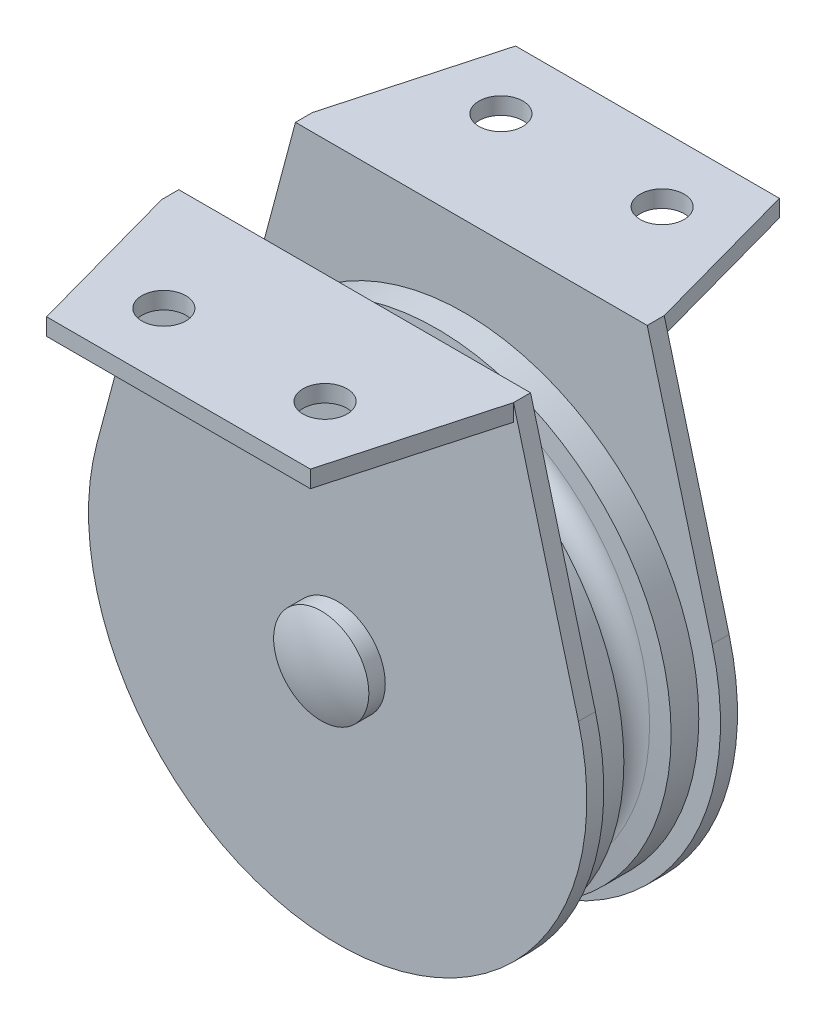
ISO-10303-21;
HEADER;
FILE_DESCRIPTION(('STEP AP214'),'2;1');
FILE_NAME('part.step','',(''),(''),'','','');
FILE_SCHEMA(('AUTOMOTIVE_DESIGN { 1 0 10303 214 1 1 1 1 }'));
ENDSEC;
DATA;
#1=APPLICATION_CONTEXT('core data for automotive mechanical design processes');
#2=APPLICATION_PROTOCOL_DEFINITION('international standard','automotive_design',2000,#1);
#3=PRODUCT_CONTEXT('',#1,'mechanical');
#4=PRODUCT('Part','Part','',(#3));
#5=PRODUCT_RELATED_PRODUCT_CATEGORY('part','',(#4));
#6=PRODUCT_DEFINITION_FORMATION('','',#4);
#7=PRODUCT_DEFINITION_CONTEXT('part definition',#1,'design');
#8=PRODUCT_DEFINITION('design','',#6,#7);
#9=PRODUCT_DEFINITION_SHAPE('','',#8);
#10=(LENGTH_UNIT() NAMED_UNIT(*) SI_UNIT(.MILLI.,.METRE.));
#11=(NAMED_UNIT(*) PLANE_ANGLE_UNIT() SI_UNIT($,.RADIAN.));
#12=(NAMED_UNIT(*) SI_UNIT($,.STERADIAN.) SOLID_ANGLE_UNIT());
#13=UNCERTAINTY_MEASURE_WITH_UNIT(LENGTH_MEASURE(1.E-05),#10,'distance_accuracy_value','');
#14=(GEOMETRIC_REPRESENTATION_CONTEXT(3) GLOBAL_UNCERTAINTY_ASSIGNED_CONTEXT((#13)) GLOBAL_UNIT_ASSIGNED_CONTEXT((#10,
#11,#12)) REPRESENTATION_CONTEXT('',''));
#15=CARTESIAN_POINT('',(0.,0.,0.));
#16=DIRECTION('',(0.,0.,1.));
#17=DIRECTION('',(1.,0.,0.));
#18=AXIS2_PLACEMENT_3D('',#15,#16,#17);
#19=CARTESIAN_POINT('',(0.,0.,-9.93775));
#20=DIRECTION('',(0.,0.,1.));
#21=DIRECTION('',(1.,0.,0.));
#22=AXIS2_PLACEMENT_3D('',#19,#20,#21);
#23=CYLINDRICAL_SURFACE('',#22,6.35);
#24=CARTESIAN_POINT('',(0.,0.,-9.93775));
#25=DIRECTION('',(0.,0.,-1.));
#26=DIRECTION('',(-1.,0.,0.));
#27=AXIS2_PLACEMENT_3D('',#24,#25,#26);
#28=CIRCLE('',#27,6.35);
#29=CARTESIAN_POINT('',(-6.35,0.,-9.93775));
#30=VERTEX_POINT('',#29);
#31=EDGE_CURVE('E11',#30,#30,#28,.T.);
#32=ORIENTED_EDGE('',*,*,#31,.F.);
#33=EDGE_LOOP('',(#32));
#34=FACE_BOUND('',#33,.T.);
#35=CARTESIAN_POINT('',(0.,0.,-8.15975));
#36=DIRECTION('',(0.,0.,-1.));
#37=DIRECTION('',(-1.,0.,0.));
#38=AXIS2_PLACEMENT_3D('',#35,#36,#37);
#39=CIRCLE('',#38,6.35);
#40=CARTESIAN_POINT('',(-6.35,0.,-8.15975));
#41=VERTEX_POINT('',#40);
#42=EDGE_CURVE('E50',#41,#41,#39,.T.);
#43=ORIENTED_EDGE('',*,*,#42,.T.);
#44=EDGE_LOOP('',(#43));
#45=FACE_BOUND('',#44,.T.);
#46=ADVANCED_FACE('F43',(#34,#45),#23,.T.);
#47=CARTESIAN_POINT('',(0.,0.,-6.83080897435897));
#48=DIRECTION('',(0.,0.,1.));
#49=DIRECTION('',(1.,0.,0.));
#50=AXIS2_PLACEMENT_3D('',#47,#48,#49);
#51=SPHERICAL_SURFACE('',#50,7.06934102564103);
#52=ORIENTED_EDGE('',*,*,#31,.T.);
#53=EDGE_LOOP('',(#52));
#54=FACE_BOUND('',#53,.T.);
#55=ADVANCED_FACE('F45',(#54),#51,.T.);
#56=CARTESIAN_POINT('',(0.,0.,-8.15975));
#57=DIRECTION('',(0.,0.,-1.));
#58=DIRECTION('',(-1.,0.,0.));
#59=AXIS2_PLACEMENT_3D('',#56,#57,#58);
#60=PLANE('',#59);
#61=ORIENTED_EDGE('',*,*,#42,.F.);
#62=EDGE_LOOP('',(#61));
#63=FACE_BOUND('',#62,.T.);
#64=ADVANCED_FACE('F57',(#63),#60,.F.);
#65=CLOSED_SHELL('',(#46,#55,#64));
#66=MANIFOLD_SOLID_BREP('B2',#65);
#67=CARTESIAN_POINT('',(-19.05,33.3375,-8.15975));
#68=DIRECTION('',(0.96632078840306,-0.257340501864918,0.));
#69=DIRECTION('',(0.257340501864918,0.96632078840306,0.));
#70=AXIS2_PLACEMENT_3D('',#67,#68,#69);
#71=PLANE('',#70);
#72=DIRECTION('',(-0.257340501864918,-0.96632078840306,0.));
#73=VECTOR('',#72,1.);
#74=CARTESIAN_POINT('',(-19.05,33.3375,-6.31825));
#75=LINE('',#74,#73);
#76=CARTESIAN_POINT('',(-19.05,33.3375,-6.31825));
#77=VERTEX_POINT('',#76);
#78=CARTESIAN_POINT('',(-26.0785822770276,6.94497679407947,-6.31825));
#79=VERTEX_POINT('',#78);
#80=EDGE_CURVE('E171',#77,#79,#75,.T.);
#81=ORIENTED_EDGE('',*,*,#80,.F.);
#82=DIRECTION('',(0.,0.,1.));
#83=VECTOR('',#82,1.);
#84=CARTESIAN_POINT('',(-19.05,33.3375,-8.15975));
#85=LINE('',#84,#83);
#86=CARTESIAN_POINT('',(-19.05,33.3375,-8.15975));
#87=VERTEX_POINT('',#86);
#88=EDGE_CURVE('E209',#87,#77,#85,.T.);
#89=ORIENTED_EDGE('',*,*,#88,.F.);
#90=DIRECTION('',(-0.257340501864918,-0.96632078840306,0.));
#91=VECTOR('',#90,1.);
#92=CARTESIAN_POINT('',(-19.05,33.3375,-8.15975));
#93=LINE('',#92,#91);
#94=CARTESIAN_POINT('',(-26.0785822770276,6.94497679407947,-8.15975));
#95=VERTEX_POINT('',#94);
#96=EDGE_CURVE('E202',#87,#95,#93,.T.);
#97=ORIENTED_EDGE('',*,*,#96,.T.);
#98=DIRECTION('',(0.,0.,1.));
#99=VECTOR('',#98,1.);
#100=CARTESIAN_POINT('',(-26.0785822770276,6.94497679407947,-8.15975));
#101=LINE('',#100,#99);
#102=EDGE_CURVE('E41',#95,#79,#101,.T.);
#103=ORIENTED_EDGE('',*,*,#102,.T.);
#104=EDGE_LOOP('',(#81,#89,#97,#103));
#105=FACE_BOUND('',#104,.T.);
#106=ADVANCED_FACE('F92',(#105),#71,.F.);
#107=CARTESIAN_POINT('',(0.,0.,-8.15975));
#108=DIRECTION('',(0.,0.,1.));
#109=DIRECTION('',(-1.,0.,0.));
#110=AXIS2_PLACEMENT_3D('',#107,#108,#109);
#111=CYLINDRICAL_SURFACE('',#110,26.9875);
#112=CARTESIAN_POINT('',(0.,0.,-6.31825));
#113=DIRECTION('',(0.,0.,1.));
#114=DIRECTION('',(1.,0.,0.));
#115=AXIS2_PLACEMENT_3D('',#112,#113,#114);
#116=CIRCLE('',#115,26.9875);
#117=CARTESIAN_POINT('',(26.0785822770276,6.94497679407947,-6.31825));
#118=VERTEX_POINT('',#117);
#119=EDGE_CURVE('E211',#79,#118,#116,.T.);
#120=ORIENTED_EDGE('',*,*,#119,.F.);
#121=ORIENTED_EDGE('',*,*,#102,.F.);
#122=CARTESIAN_POINT('',(0.,0.,-8.15975));
#123=DIRECTION('',(0.,0.,1.));
#124=DIRECTION('',(1.,0.,0.));
#125=AXIS2_PLACEMENT_3D('',#122,#123,#124);
#126=CIRCLE('',#125,26.9875);
#127=CARTESIAN_POINT('',(26.0785822770276,6.94497679407947,-8.15975));
#128=VERTEX_POINT('',#127);
#129=EDGE_CURVE('E136',#95,#128,#126,.T.);
#130=ORIENTED_EDGE('',*,*,#129,.T.);
#131=DIRECTION('',(0.,0.,1.));
#132=VECTOR('',#131,1.);
#133=CARTESIAN_POINT('',(26.0785822770276,6.94497679407947,-8.15975));
#134=LINE('',#133,#132);
#135=EDGE_CURVE('E100',#128,#118,#134,.T.);
#136=ORIENTED_EDGE('',*,*,#135,.T.);
#137=EDGE_LOOP('',(#120,#121,#130,#136));
#138=FACE_BOUND('',#137,.T.);
#139=ADVANCED_FACE('F222',(#138),#111,.T.);
#140=CARTESIAN_POINT('',(26.0785822770276,6.94497679407947,-8.15975));
#141=DIRECTION('',(-0.96632078840306,-0.257340501864918,0.));
#142=DIRECTION('',(0.257340501864918,-0.96632078840306,0.));
#143=AXIS2_PLACEMENT_3D('',#140,#141,#142);
#144=PLANE('',#143);
#145=DIRECTION('',(-0.257340501864918,0.96632078840306,0.));
#146=VECTOR('',#145,1.);
#147=CARTESIAN_POINT('',(26.0785822770276,6.94497679407947,-6.31825));
#148=LINE('',#147,#146);
#149=CARTESIAN_POINT('',(19.05,33.3375,-6.31825));
#150=VERTEX_POINT('',#149);
#151=EDGE_CURVE('E214',#118,#150,#148,.T.);
#152=ORIENTED_EDGE('',*,*,#151,.F.);
#153=ORIENTED_EDGE('',*,*,#135,.F.);
#154=DIRECTION('',(-0.257340501864918,0.96632078840306,0.));
#155=VECTOR('',#154,1.);
#156=CARTESIAN_POINT('',(26.0785822770276,6.94497679407947,-8.15975));
#157=LINE('',#156,#155);
#158=CARTESIAN_POINT('',(19.05,33.3375,-8.15975000000001));
#159=VERTEX_POINT('',#158);
#160=EDGE_CURVE('E206',#128,#159,#157,.T.);
#161=ORIENTED_EDGE('',*,*,#160,.T.);
#162=DIRECTION('',(0.,0.,1.));
#163=VECTOR('',#162,1.);
#164=CARTESIAN_POINT('',(19.05,33.3375,-8.15975));
#165=LINE('',#164,#163);
#166=EDGE_CURVE('E218',#159,#150,#165,.T.);
#167=ORIENTED_EDGE('',*,*,#166,.T.);
#168=EDGE_LOOP('',(#152,#153,#161,#167));
#169=FACE_BOUND('',#168,.T.);
#170=ADVANCED_FACE('F231',(#169),#144,.F.);
#171=CARTESIAN_POINT('',(19.05,33.3375,-8.15975));
#172=DIRECTION('',(0.,-1.,0.));
#173=DIRECTION('',(0.,0.,1.));
#174=AXIS2_PLACEMENT_3D('',#171,#172,#173);
#175=PLANE('',#174);
#176=DIRECTION('',(-1.,0.,0.));
#177=VECTOR('',#176,1.);
#178=CARTESIAN_POINT('',(19.05,33.3375,-6.31825));
#179=LINE('',#178,#177);
#180=EDGE_CURVE('E127',#150,#77,#179,.T.);
#181=ORIENTED_EDGE('',*,*,#180,.F.);
#182=ORIENTED_EDGE('',*,*,#166,.F.);
#183=DIRECTION('',(-0.266270278169143,0.,-0.963898406972295));
#184=VECTOR('',#183,1.);
#185=CARTESIAN_POINT('',(14.2875,33.3375,-25.4));
#186=LINE('',#185,#184);
#187=CARTESIAN_POINT('',(14.2875,33.3375,-25.4));
#188=VERTEX_POINT('',#187);
#189=EDGE_CURVE('E195',#159,#188,#186,.T.);
#190=ORIENTED_EDGE('',*,*,#189,.T.);
#191=DIRECTION('',(-1.,0.,0.));
#192=VECTOR('',#191,1.);
#193=CARTESIAN_POINT('',(14.2875,33.3375,-25.4));
#194=LINE('',#193,#192);
#195=CARTESIAN_POINT('',(-14.2875,33.3375,-25.4));
#196=VERTEX_POINT('',#195);
#197=EDGE_CURVE('E166',#188,#196,#194,.T.);
#198=ORIENTED_EDGE('',*,*,#197,.T.);
#199=DIRECTION('',(-0.266270278169142,0.,0.963898406972295));
#200=VECTOR('',#199,1.);
#201=CARTESIAN_POINT('',(-14.2875,33.3375,-25.4));
#202=LINE('',#201,#200);
#203=EDGE_CURVE('E185',#196,#87,#202,.T.);
#204=ORIENTED_EDGE('',*,*,#203,.T.);
#205=ORIENTED_EDGE('',*,*,#88,.T.);
#206=EDGE_LOOP('',(#181,#182,#190,#198,#204,#205));
#207=FACE_BOUND('',#206,.T.);
#208=CARTESIAN_POINT('',(8.73125,33.3375,-18.25625));
#209=DIRECTION('',(0.,1.,0.));
#210=DIRECTION('',(0.,0.,1.));
#211=AXIS2_PLACEMENT_3D('',#208,#209,#210);
#212=CIRCLE('',#211,2.38125);
#213=CARTESIAN_POINT('',(8.73125,33.3375,-15.875));
#214=VERTEX_POINT('',#213);
#215=EDGE_CURVE('E189',#214,#214,#212,.T.);
#216=ORIENTED_EDGE('',*,*,#215,.F.);
#217=EDGE_LOOP('',(#216));
#218=FACE_BOUND('',#217,.T.);
#219=CARTESIAN_POINT('',(-8.73125,33.3375,-18.25625));
#220=DIRECTION('',(0.,1.,0.));
#221=DIRECTION('',(0.,0.,1.));
#222=AXIS2_PLACEMENT_3D('',#219,#220,#221);
#223=CIRCLE('',#222,2.38125);
#224=CARTESIAN_POINT('',(-8.73125,33.3375,-15.875));
#225=VERTEX_POINT('',#224);
#226=EDGE_CURVE('E336',#225,#225,#223,.T.);
#227=ORIENTED_EDGE('',*,*,#226,.F.);
#228=EDGE_LOOP('',(#227));
#229=FACE_BOUND('',#228,.T.);
#230=ADVANCED_FACE('F229',(#207,#218,#229),#175,.F.);
#231=CARTESIAN_POINT('',(0.,0.,-8.15975));
#232=DIRECTION('',(0.,0.,-1.));
#233=DIRECTION('',(1.,0.,0.));
#234=AXIS2_PLACEMENT_3D('',#231,#232,#233);
#235=PLANE('',#234);
#236=DIRECTION('',(0.,1.,0.));
#237=VECTOR('',#236,1.);
#238=CARTESIAN_POINT('',(19.05,31.496,-8.15975000000001));
#239=LINE('',#238,#237);
#240=CARTESIAN_POINT('',(19.05,31.496,-8.15975000000001));
#241=VERTEX_POINT('',#240);
#242=EDGE_CURVE('E184',#241,#159,#239,.T.);
#243=ORIENTED_EDGE('',*,*,#242,.T.);
#244=ORIENTED_EDGE('',*,*,#160,.F.);
#245=ORIENTED_EDGE('',*,*,#129,.F.);
#246=ORIENTED_EDGE('',*,*,#96,.F.);
#247=DIRECTION('',(0.,1.,0.));
#248=VECTOR('',#247,1.);
#249=CARTESIAN_POINT('',(-19.05,31.496,-8.15975000000001));
#250=LINE('',#249,#248);
#251=CARTESIAN_POINT('',(-19.05,31.496,-8.15975000000001));
#252=VERTEX_POINT('',#251);
#253=EDGE_CURVE('E108',#252,#87,#250,.T.);
#254=ORIENTED_EDGE('',*,*,#253,.F.);
#255=DIRECTION('',(1.,0.,0.));
#256=VECTOR('',#255,1.);
#257=CARTESIAN_POINT('',(19.05,31.496,-8.15975000000001));
#258=LINE('',#257,#256);
#259=EDGE_CURVE('E193',#252,#241,#258,.T.);
#260=ORIENTED_EDGE('',*,*,#259,.T.);
#261=EDGE_LOOP('',(#243,#244,#245,#246,#254,#260));
#262=FACE_BOUND('',#261,.T.);
#263=ADVANCED_FACE('F228',(#262),#235,.T.);
#264=CARTESIAN_POINT('',(0.,0.,-6.31825));
#265=DIRECTION('',(0.,0.,-1.));
#266=DIRECTION('',(1.,0.,0.));
#267=AXIS2_PLACEMENT_3D('',#264,#265,#266);
#268=PLANE('',#267);
#269=ORIENTED_EDGE('',*,*,#80,.T.);
#270=ORIENTED_EDGE('',*,*,#119,.T.);
#271=ORIENTED_EDGE('',*,*,#151,.T.);
#272=ORIENTED_EDGE('',*,*,#180,.T.);
#273=EDGE_LOOP('',(#269,#270,#271,#272));
#274=FACE_BOUND('',#273,.T.);
#275=ADVANCED_FACE('F224',(#274),#268,.F.);
#276=CARTESIAN_POINT('',(19.05,31.496,-8.15975000000001));
#277=DIRECTION('',(0.,1.,0.));
#278=DIRECTION('',(0.,0.,-1.));
#279=AXIS2_PLACEMENT_3D('',#276,#277,#278);
#280=PLANE('',#279);
#281=DIRECTION('',(-0.266270278169143,0.,-0.963898406972295));
#282=VECTOR('',#281,1.);
#283=CARTESIAN_POINT('',(14.2875,31.496,-25.4));
#284=LINE('',#283,#282);
#285=CARTESIAN_POINT('',(14.2875,31.496,-25.4));
#286=VERTEX_POINT('',#285);
#287=EDGE_CURVE('E178',#241,#286,#284,.T.);
#288=ORIENTED_EDGE('',*,*,#287,.F.);
#289=ORIENTED_EDGE('',*,*,#259,.F.);
#290=DIRECTION('',(-0.266270278169142,0.,0.963898406972295));
#291=VECTOR('',#290,1.);
#292=CARTESIAN_POINT('',(-14.2875,31.496,-25.4));
#293=LINE('',#292,#291);
#294=CARTESIAN_POINT('',(-14.2875,31.496,-25.4));
#295=VERTEX_POINT('',#294);
#296=EDGE_CURVE('E180',#295,#252,#293,.T.);
#297=ORIENTED_EDGE('',*,*,#296,.F.);
#298=DIRECTION('',(-1.,0.,0.));
#299=VECTOR('',#298,1.);
#300=CARTESIAN_POINT('',(14.2875,31.496,-25.4));
#301=LINE('',#300,#299);
#302=EDGE_CURVE('E163',#286,#295,#301,.T.);
#303=ORIENTED_EDGE('',*,*,#302,.F.);
#304=EDGE_LOOP('',(#288,#289,#297,#303));
#305=FACE_BOUND('',#304,.T.);
#306=CARTESIAN_POINT('',(8.73125,31.496,-18.25625));
#307=DIRECTION('',(0.,1.,0.));
#308=DIRECTION('',(0.,0.,1.));
#309=AXIS2_PLACEMENT_3D('',#306,#307,#308);
#310=CIRCLE('',#309,2.38125);
#311=CARTESIAN_POINT('',(8.73125,31.496,-15.875));
#312=VERTEX_POINT('',#311);
#313=EDGE_CURVE('E197',#312,#312,#310,.T.);
#314=ORIENTED_EDGE('',*,*,#313,.T.);
#315=EDGE_LOOP('',(#314));
#316=FACE_BOUND('',#315,.T.);
#317=CARTESIAN_POINT('',(-8.73125,31.496,-18.25625));
#318=DIRECTION('',(0.,1.,0.));
#319=DIRECTION('',(0.,0.,1.));
#320=AXIS2_PLACEMENT_3D('',#317,#318,#319);
#321=CIRCLE('',#320,2.38125);
#322=CARTESIAN_POINT('',(-8.73125,31.496,-15.875));
#323=VERTEX_POINT('',#322);
#324=EDGE_CURVE('E333',#323,#323,#321,.T.);
#325=ORIENTED_EDGE('',*,*,#324,.T.);
#326=EDGE_LOOP('',(#325));
#327=FACE_BOUND('',#326,.T.);
#328=ADVANCED_FACE('F175',(#305,#316,#327),#280,.F.);
#329=CARTESIAN_POINT('',(14.2875,31.496,-25.4));
#330=DIRECTION('',(-0.963898406972295,0.,0.266270278169143));
#331=DIRECTION('',(-0.266270278169143,0.,-0.963898406972295));
#332=AXIS2_PLACEMENT_3D('',#329,#330,#331);
#333=PLANE('',#332);
#334=ORIENTED_EDGE('',*,*,#189,.F.);
#335=ORIENTED_EDGE('',*,*,#242,.F.);
#336=ORIENTED_EDGE('',*,*,#287,.T.);
#337=DIRECTION('',(0.,1.,0.));
#338=VECTOR('',#337,1.);
#339=CARTESIAN_POINT('',(14.2875,31.496,-25.4));
#340=LINE('',#339,#338);
#341=EDGE_CURVE('E160',#286,#188,#340,.T.);
#342=ORIENTED_EDGE('',*,*,#341,.T.);
#343=EDGE_LOOP('',(#334,#335,#336,#342));
#344=FACE_BOUND('',#343,.T.);
#345=ADVANCED_FACE('F183',(#344),#333,.F.);
#346=CARTESIAN_POINT('',(14.2875,31.496,-25.4));
#347=DIRECTION('',(0.,0.,1.));
#348=DIRECTION('',(-1.,0.,0.));
#349=AXIS2_PLACEMENT_3D('',#346,#347,#348);
#350=PLANE('',#349);
#351=ORIENTED_EDGE('',*,*,#197,.F.);
#352=ORIENTED_EDGE('',*,*,#341,.F.);
#353=ORIENTED_EDGE('',*,*,#302,.T.);
#354=DIRECTION('',(0.,1.,0.));
#355=VECTOR('',#354,1.);
#356=CARTESIAN_POINT('',(-14.2875,31.496,-25.4));
#357=LINE('',#356,#355);
#358=EDGE_CURVE('E172',#295,#196,#357,.T.);
#359=ORIENTED_EDGE('',*,*,#358,.T.);
#360=EDGE_LOOP('',(#351,#352,#353,#359));
#361=FACE_BOUND('',#360,.T.);
#362=ADVANCED_FACE('F162',(#361),#350,.F.);
#363=CARTESIAN_POINT('',(-14.2875,31.496,-25.4));
#364=DIRECTION('',(0.963898406972295,0.,0.266270278169142));
#365=DIRECTION('',(-0.266270278169142,0.,0.963898406972295));
#366=AXIS2_PLACEMENT_3D('',#363,#364,#365);
#367=PLANE('',#366);
#368=ORIENTED_EDGE('',*,*,#203,.F.);
#369=ORIENTED_EDGE('',*,*,#358,.F.);
#370=ORIENTED_EDGE('',*,*,#296,.T.);
#371=ORIENTED_EDGE('',*,*,#253,.T.);
#372=EDGE_LOOP('',(#368,#369,#370,#371));
#373=FACE_BOUND('',#372,.T.);
#374=ADVANCED_FACE('F298',(#373),#367,.F.);
#375=CARTESIAN_POINT('',(8.73125,31.496,-18.25625));
#376=DIRECTION('',(0.,1.,0.));
#377=DIRECTION('',(0.,0.,-1.));
#378=AXIS2_PLACEMENT_3D('',#375,#376,#377);
#379=CYLINDRICAL_SURFACE('',#378,2.38125);
#380=ORIENTED_EDGE('',*,*,#313,.F.);
#381=EDGE_LOOP('',(#380));
#382=FACE_BOUND('',#381,.T.);
#383=ORIENTED_EDGE('',*,*,#215,.T.);
#384=EDGE_LOOP('',(#383));
#385=FACE_BOUND('',#384,.T.);
#386=ADVANCED_FACE('F307',(#382,#385),#379,.F.);
#387=CARTESIAN_POINT('',(-8.73125,31.496,-18.25625));
#388=DIRECTION('',(0.,1.,0.));
#389=DIRECTION('',(0.,0.,-1.));
#390=AXIS2_PLACEMENT_3D('',#387,#388,#389);
#391=CYLINDRICAL_SURFACE('',#390,2.38125);
#392=ORIENTED_EDGE('',*,*,#324,.F.);
#393=EDGE_LOOP('',(#392));
#394=FACE_BOUND('',#393,.T.);
#395=ORIENTED_EDGE('',*,*,#226,.T.);
#396=EDGE_LOOP('',(#395));
#397=FACE_BOUND('',#396,.T.);
#398=ADVANCED_FACE('F316',(#394,#397),#391,.F.);
#399=CLOSED_SHELL('',(#106,#139,#170,#230,#263,#275,#328,#345,#362,#374,#386,#398));
#400=MANIFOLD_SOLID_BREP('B6',#399);
#401=CARTESIAN_POINT('',(0.,0.,-18.2715183923239));
#402=DIRECTION('',(0.,0.,1.));
#403=DIRECTION('',(1.,0.,0.));
#404=AXIS2_PLACEMENT_3D('',#401,#402,#403);
#405=CYLINDRICAL_SURFACE('',#404,3.57505);
#406=CARTESIAN_POINT('',(0.,0.,5.55625));
#407=DIRECTION('',(0.,0.,-1.));
#408=DIRECTION('',(-1.,0.,0.));
#409=AXIS2_PLACEMENT_3D('',#406,#407,#408);
#410=CIRCLE('',#409,3.57505);
#411=CARTESIAN_POINT('',(-3.57505,0.,5.55625));
#412=VERTEX_POINT('',#411);
#413=EDGE_CURVE('E484',#412,#412,#410,.T.);
#414=ORIENTED_EDGE('',*,*,#413,.F.);
#415=EDGE_LOOP('',(#414));
#416=FACE_BOUND('',#415,.T.);
#417=CARTESIAN_POINT('',(0.,0.,6.31825));
#418=DIRECTION('',(0.,0.,1.));
#419=DIRECTION('',(1.,0.,0.));
#420=AXIS2_PLACEMENT_3D('',#417,#418,#419);
#421=CIRCLE('',#420,3.57505);
#422=CARTESIAN_POINT('',(3.57505,0.,6.31825));
#423=VERTEX_POINT('',#422);
#424=EDGE_CURVE('E356',#423,#423,#421,.F.);
#425=ORIENTED_EDGE('',*,*,#424,.T.);
#426=EDGE_LOOP('',(#425));
#427=FACE_BOUND('',#426,.T.);
#428=ADVANCED_FACE('F352',(#416,#427),#405,.T.);
#429=CARTESIAN_POINT('',(0.,0.,5.55625));
#430=DIRECTION('',(0.,0.,1.));
#431=DIRECTION('',(1.,0.,0.));
#432=AXIS2_PLACEMENT_3D('',#429,#430,#431);
#433=CYLINDRICAL_SURFACE('',#432,25.4);
#434=CARTESIAN_POINT('',(0.,0.,5.55625));
#435=DIRECTION('',(0.,0.,1.));
#436=DIRECTION('',(1.,0.,0.));
#437=AXIS2_PLACEMENT_3D('',#434,#435,#436);
#438=CIRCLE('',#437,25.4);
#439=CARTESIAN_POINT('',(25.4,0.,5.55625));
#440=VERTEX_POINT('',#439);
#441=EDGE_CURVE('E488',#440,#440,#438,.T.);
#442=ORIENTED_EDGE('',*,*,#441,.F.);
#443=EDGE_LOOP('',(#442));
#444=FACE_BOUND('',#443,.T.);
#445=CARTESIAN_POINT('',(0.,0.,2.55978965723393));
#446=DIRECTION('',(0.,0.,1.));
#447=DIRECTION('',(1.,0.,0.));
#448=AXIS2_PLACEMENT_3D('',#445,#446,#447);
#449=CIRCLE('',#448,25.4);
#450=CARTESIAN_POINT('',(25.4,0.,2.55978965723393));
#451=VERTEX_POINT('',#450);
#452=EDGE_CURVE('E90',#451,#451,#449,.T.);
#453=ORIENTED_EDGE('',*,*,#452,.T.);
#454=EDGE_LOOP('',(#453));
#455=FACE_BOUND('',#454,.T.);
#456=ADVANCED_FACE('F354',(#444,#455),#433,.T.);
#457=CARTESIAN_POINT('',(0.,0.,2.37218862483097));
#458=DIRECTION('',(0.,0.,1.));
#459=DIRECTION('',(1.,0.,0.));
#460=AXIS2_PLACEMENT_3D('',#457,#458,#459);
#461=CONICAL_SURFACE('',#460,23.2557103875821,1.48352986419518);
#462=ORIENTED_EDGE('',*,*,#452,.F.);
#463=EDGE_LOOP('',(#462));
#464=FACE_BOUND('',#463,.T.);
#465=CARTESIAN_POINT('',(0.,0.,2.37218862483097));
#466=DIRECTION('',(0.,0.,1.));
#467=DIRECTION('',(1.,0.,0.));
#468=AXIS2_PLACEMENT_3D('',#465,#466,#467);
#469=CIRCLE('',#468,23.2557103875821);
#470=CARTESIAN_POINT('',(23.2557103875821,0.,2.37218862483097));
#471=VERTEX_POINT('',#470);
#472=EDGE_CURVE('E362',#471,#471,#469,.T.);
#473=ORIENTED_EDGE('',*,*,#472,.T.);
#474=EDGE_LOOP('',(#473));
#475=FACE_BOUND('',#474,.T.);
#476=ADVANCED_FACE('F598',(#464,#475),#461,.T.);
#477=CARTESIAN_POINT('',(0.,0.,0.));
#478=DIRECTION('',(0.,0.,1.));
#479=DIRECTION('',(1.,0.,0.));
#480=AXIS2_PLACEMENT_3D('',#477,#478,#479);
#481=TOROIDAL_SURFACE('',#480,23.46325,2.38125);
#482=ORIENTED_EDGE('',*,*,#472,.F.);
#483=EDGE_LOOP('',(#482));
#484=FACE_BOUND('',#483,.T.);
#485=CARTESIAN_POINT('',(0.,0.,-2.37218862483097));
#486=DIRECTION('',(0.,0.,1.));
#487=DIRECTION('',(1.,0.,0.));
#488=AXIS2_PLACEMENT_3D('',#485,#486,#487);
#489=CIRCLE('',#488,23.2557103875821);
#490=CARTESIAN_POINT('',(23.2557103875821,0.,-2.37218862483097));
#491=VERTEX_POINT('',#490);
#492=EDGE_CURVE('E497',#491,#491,#489,.T.);
#493=ORIENTED_EDGE('',*,*,#492,.T.);
#494=EDGE_LOOP('',(#493));
#495=FACE_BOUND('',#494,.T.);
#496=ADVANCED_FACE('F595',(#484,#495),#481,.F.);
#497=CARTESIAN_POINT('',(0.,0.,-2.55978965723393));
#498=DIRECTION('',(0.,0.,-1.));
#499=DIRECTION('',(-1.,0.,0.));
#500=AXIS2_PLACEMENT_3D('',#497,#498,#499);
#501=CONICAL_SURFACE('',#500,25.4,1.48352986419518);
#502=ORIENTED_EDGE('',*,*,#492,.F.);
#503=EDGE_LOOP('',(#502));
#504=FACE_BOUND('',#503,.T.);
#505=CARTESIAN_POINT('',(0.,0.,-2.55978965723393));
#506=DIRECTION('',(0.,0.,1.));
#507=DIRECTION('',(1.,0.,0.));
#508=AXIS2_PLACEMENT_3D('',#505,#506,#507);
#509=CIRCLE('',#508,25.4);
#510=CARTESIAN_POINT('',(25.4,0.,-2.55978965723393));
#511=VERTEX_POINT('',#510);
#512=EDGE_CURVE('E494',#511,#511,#509,.T.);
#513=ORIENTED_EDGE('',*,*,#512,.T.);
#514=EDGE_LOOP('',(#513));
#515=FACE_BOUND('',#514,.T.);
#516=ADVANCED_FACE('F591',(#504,#515),#501,.T.);
#517=CARTESIAN_POINT('',(0.,0.,5.55625));
#518=DIRECTION('',(0.,0.,1.));
#519=DIRECTION('',(1.,0.,0.));
#520=AXIS2_PLACEMENT_3D('',#517,#518,#519);
#521=CYLINDRICAL_SURFACE('',#520,25.4);
#522=ORIENTED_EDGE('',*,*,#512,.F.);
#523=EDGE_LOOP('',(#522));
#524=FACE_BOUND('',#523,.T.);
#525=CARTESIAN_POINT('',(0.,0.,-5.55625));
#526=DIRECTION('',(0.,0.,1.));
#527=DIRECTION('',(1.,0.,0.));
#528=AXIS2_PLACEMENT_3D('',#525,#526,#527);
#529=CIRCLE('',#528,25.4);
#530=CARTESIAN_POINT('',(25.4,0.,-5.55625));
#531=VERTEX_POINT('',#530);
#532=EDGE_CURVE('E491',#531,#531,#529,.T.);
#533=ORIENTED_EDGE('',*,*,#532,.T.);
#534=EDGE_LOOP('',(#533));
#535=FACE_BOUND('',#534,.T.);
#536=ADVANCED_FACE('F587',(#524,#535),#521,.T.);
#537=CARTESIAN_POINT('',(0.,0.,-5.55625));
#538=DIRECTION('',(0.,0.,1.));
#539=DIRECTION('',(1.,0.,0.));
#540=AXIS2_PLACEMENT_3D('',#537,#538,#539);
#541=PLANE('',#540);
#542=CARTESIAN_POINT('',(0.,0.,-5.55625));
#543=DIRECTION('',(0.,0.,1.));
#544=DIRECTION('',(1.,0.,0.));
#545=AXIS2_PLACEMENT_3D('',#542,#543,#544);
#546=CIRCLE('',#545,3.57505);
#547=CARTESIAN_POINT('',(3.57505,0.,-5.55625));
#548=VERTEX_POINT('',#547);
#549=EDGE_CURVE('E485',#548,#548,#546,.T.);
#550=ORIENTED_EDGE('',*,*,#549,.T.);
#551=EDGE_LOOP('',(#550));
#552=FACE_BOUND('',#551,.T.);
#553=ORIENTED_EDGE('',*,*,#532,.F.);
#554=EDGE_LOOP('',(#553));
#555=FACE_BOUND('',#554,.T.);
#556=ADVANCED_FACE('F584',(#552,#555),#541,.F.);
#557=CARTESIAN_POINT('',(0.,25.4,5.55625));
#558=DIRECTION('',(0.,0.,-1.));
#559=DIRECTION('',(-1.,0.,0.));
#560=AXIS2_PLACEMENT_3D('',#557,#558,#559);
#561=PLANE('',#560);
#562=ORIENTED_EDGE('',*,*,#413,.T.);
#563=EDGE_LOOP('',(#562));
#564=FACE_BOUND('',#563,.T.);
#565=ORIENTED_EDGE('',*,*,#441,.T.);
#566=EDGE_LOOP('',(#565));
#567=FACE_BOUND('',#566,.T.);
#568=ADVANCED_FACE('F504',(#564,#567),#561,.F.);
#569=CARTESIAN_POINT('',(0.,0.,-8.15975));
#570=DIRECTION('',(0.,0.,-1.));
#571=DIRECTION('',(-1.,0.,0.));
#572=AXIS2_PLACEMENT_3D('',#569,#570,#571);
#573=CIRCLE('',#572,3.57505);
#574=CARTESIAN_POINT('',(-3.57505,0.,-8.15975));
#575=VERTEX_POINT('',#574);
#576=EDGE_CURVE('E481',#575,#575,#573,.F.);
#577=ORIENTED_EDGE('',*,*,#576,.T.);
#578=EDGE_LOOP('',(#577));
#579=FACE_BOUND('',#578,.T.);
#580=ORIENTED_EDGE('',*,*,#549,.F.);
#581=EDGE_LOOP('',(#580));
#582=FACE_BOUND('',#581,.T.);
#583=ADVANCED_FACE('F510',(#579,#582),#405,.T.);
#584=CARTESIAN_POINT('',(0.,0.,-8.15975));
#585=DIRECTION('',(0.,0.,-1.));
#586=DIRECTION('',(1.,0.,0.));
#587=AXIS2_PLACEMENT_3D('',#584,#585,#586);
#588=PLANE('',#587);
#589=ORIENTED_EDGE('',*,*,#576,.F.);
#590=EDGE_LOOP('',(#589));
#591=FACE_BOUND('',#590,.T.);
#592=ADVANCED_FACE('F556',(#591),#588,.T.);
#593=CARTESIAN_POINT('',(0.,0.,8.15975));
#594=DIRECTION('',(0.,0.,1.));
#595=DIRECTION('',(1.,0.,0.));
#596=AXIS2_PLACEMENT_3D('',#593,#594,#595);
#597=PLANE('',#596);
#598=DIRECTION('',(0.,1.,0.));
#599=VECTOR('',#598,1.);
#600=CARTESIAN_POINT('',(19.05,31.496,8.15975000000001));
#601=LINE('',#600,#599);
#602=CARTESIAN_POINT('',(19.05,31.496,8.15975000000001));
#603=VERTEX_POINT('',#602);
#604=CARTESIAN_POINT('',(19.05,33.3375,8.15975000000001));
#605=VERTEX_POINT('',#604);
#606=EDGE_CURVE('E530',#603,#605,#601,.T.);
#607=ORIENTED_EDGE('',*,*,#606,.F.);
#608=DIRECTION('',(1.,0.,0.));
#609=VECTOR('',#608,1.);
#610=CARTESIAN_POINT('',(19.05,31.496,8.15975000000001));
#611=LINE('',#610,#609);
#612=CARTESIAN_POINT('',(-19.05,31.496,8.15975000000001));
#613=VERTEX_POINT('',#612);
#614=EDGE_CURVE('E443',#613,#603,#611,.T.);
#615=ORIENTED_EDGE('',*,*,#614,.F.);
#616=DIRECTION('',(0.,1.,0.));
#617=VECTOR('',#616,1.);
#618=CARTESIAN_POINT('',(-19.05,31.496,8.15975000000001));
#619=LINE('',#618,#617);
#620=CARTESIAN_POINT('',(-19.05,33.3375,8.15975));
#621=VERTEX_POINT('',#620);
#622=EDGE_CURVE('E455',#613,#621,#619,.T.);
#623=ORIENTED_EDGE('',*,*,#622,.T.);
#624=DIRECTION('',(-0.257340501864918,-0.96632078840306,0.));
#625=VECTOR('',#624,1.);
#626=CARTESIAN_POINT('',(-19.05,33.3375,8.15975));
#627=LINE('',#626,#625);
#628=CARTESIAN_POINT('',(-26.0785822770276,6.94497679407947,8.15975));
#629=VERTEX_POINT('',#628);
#630=EDGE_CURVE('E459',#621,#629,#627,.T.);
#631=ORIENTED_EDGE('',*,*,#630,.T.);
#632=CARTESIAN_POINT('',(0.,0.,8.15975));
#633=DIRECTION('',(0.,0.,1.));
#634=DIRECTION('',(1.,0.,0.));
#635=AXIS2_PLACEMENT_3D('',#632,#633,#634);
#636=CIRCLE('',#635,26.9875);
#637=CARTESIAN_POINT('',(26.0785822770276,6.94497679407947,8.15975));
#638=VERTEX_POINT('',#637);
#639=EDGE_CURVE('E402',#629,#638,#636,.T.);
#640=ORIENTED_EDGE('',*,*,#639,.T.);
#641=DIRECTION('',(-0.257340501864918,0.96632078840306,0.));
#642=VECTOR('',#641,1.);
#643=CARTESIAN_POINT('',(26.0785822770276,6.94497679407947,8.15975));
#644=LINE('',#643,#642);
#645=EDGE_CURVE('E462',#638,#605,#644,.T.);
#646=ORIENTED_EDGE('',*,*,#645,.T.);
#647=EDGE_LOOP('',(#607,#615,#623,#631,#640,#646));
#648=FACE_BOUND('',#647,.T.);
#649=CARTESIAN_POINT('',(0.,0.,8.15975));
#650=DIRECTION('',(0.,0.,1.));
#651=DIRECTION('',(1.,0.,0.));
#652=AXIS2_PLACEMENT_3D('',#649,#650,#651);
#653=CIRCLE('',#652,5.1562);
#654=CARTESIAN_POINT('',(5.1562,0.,8.15975));
#655=VERTEX_POINT('',#654);
#656=EDGE_CURVE('E480',#655,#655,#653,.T.);
#657=ORIENTED_EDGE('',*,*,#656,.F.);
#658=EDGE_LOOP('',(#657));
#659=FACE_BOUND('',#658,.T.);
#660=ADVANCED_FACE('F532',(#648,#659),#597,.T.);
#661=CARTESIAN_POINT('',(-19.05,33.3375,8.15975));
#662=DIRECTION('',(0.96632078840306,-0.257340501864918,0.));
#663=DIRECTION('',(0.257340501864918,0.96632078840306,0.));
#664=AXIS2_PLACEMENT_3D('',#661,#662,#663);
#665=PLANE('',#664);
#666=DIRECTION('',(-0.257340501864918,-0.96632078840306,0.));
#667=VECTOR('',#666,1.);
#668=CARTESIAN_POINT('',(-19.05,33.3375,6.31825));
#669=LINE('',#668,#667);
#670=CARTESIAN_POINT('',(-19.05,33.3375,6.31825));
#671=VERTEX_POINT('',#670);
#672=CARTESIAN_POINT('',(-26.0785822770276,6.94497679407947,6.31825));
#673=VERTEX_POINT('',#672);
#674=EDGE_CURVE('E450',#671,#673,#669,.T.);
#675=ORIENTED_EDGE('',*,*,#674,.T.);
#676=DIRECTION('',(0.,0.,-1.));
#677=VECTOR('',#676,1.);
#678=CARTESIAN_POINT('',(-26.0785822770276,6.94497679407947,8.15975));
#679=LINE('',#678,#677);
#680=EDGE_CURVE('E474',#629,#673,#679,.T.);
#681=ORIENTED_EDGE('',*,*,#680,.F.);
#682=ORIENTED_EDGE('',*,*,#630,.F.);
#683=DIRECTION('',(0.,0.,-1.));
#684=VECTOR('',#683,1.);
#685=CARTESIAN_POINT('',(-19.05,33.3375,8.15975));
#686=LINE('',#685,#684);
#687=EDGE_CURVE('E464',#621,#671,#686,.T.);
#688=ORIENTED_EDGE('',*,*,#687,.T.);
#689=EDGE_LOOP('',(#675,#681,#682,#688));
#690=FACE_BOUND('',#689,.T.);
#691=ADVANCED_FACE('F522',(#690),#665,.F.);
#692=CARTESIAN_POINT('',(0.,0.,8.15975));
#693=DIRECTION('',(0.,0.,-1.));
#694=DIRECTION('',(-1.,0.,0.));
#695=AXIS2_PLACEMENT_3D('',#692,#693,#694);
#696=CYLINDRICAL_SURFACE('',#695,26.9875);
#697=CARTESIAN_POINT('',(0.,0.,6.31825));
#698=DIRECTION('',(0.,0.,1.));
#699=DIRECTION('',(1.,0.,0.));
#700=AXIS2_PLACEMENT_3D('',#697,#698,#699);
#701=CIRCLE('',#700,26.9875);
#702=CARTESIAN_POINT('',(26.0785822770276,6.94497679407947,6.31825));
#703=VERTEX_POINT('',#702);
#704=EDGE_CURVE('E453',#673,#703,#701,.T.);
#705=ORIENTED_EDGE('',*,*,#704,.T.);
#706=DIRECTION('',(0.,0.,-1.));
#707=VECTOR('',#706,1.);
#708=CARTESIAN_POINT('',(26.0785822770276,6.94497679407947,8.15975));
#709=LINE('',#708,#707);
#710=EDGE_CURVE('E472',#638,#703,#709,.T.);
#711=ORIENTED_EDGE('',*,*,#710,.F.);
#712=ORIENTED_EDGE('',*,*,#639,.F.);
#713=ORIENTED_EDGE('',*,*,#680,.T.);
#714=EDGE_LOOP('',(#705,#711,#712,#713));
#715=FACE_BOUND('',#714,.T.);
#716=ADVANCED_FACE('F562',(#715),#696,.T.);
#717=CARTESIAN_POINT('',(26.0785822770276,6.94497679407947,8.15975));
#718=DIRECTION('',(-0.96632078840306,-0.257340501864918,0.));
#719=DIRECTION('',(0.257340501864918,-0.96632078840306,0.));
#720=AXIS2_PLACEMENT_3D('',#717,#718,#719);
#721=PLANE('',#720);
#722=DIRECTION('',(-0.257340501864918,0.96632078840306,0.));
#723=VECTOR('',#722,1.);
#724=CARTESIAN_POINT('',(26.0785822770276,6.94497679407947,6.31825));
#725=LINE('',#724,#723);
#726=CARTESIAN_POINT('',(19.05,33.3375,6.31825));
#727=VERTEX_POINT('',#726);
#728=EDGE_CURVE('E390',#703,#727,#725,.T.);
#729=ORIENTED_EDGE('',*,*,#728,.T.);
#730=DIRECTION('',(0.,0.,-1.));
#731=VECTOR('',#730,1.);
#732=CARTESIAN_POINT('',(19.05,33.3375,8.15975));
#733=LINE('',#732,#731);
#734=EDGE_CURVE('E470',#605,#727,#733,.T.);
#735=ORIENTED_EDGE('',*,*,#734,.F.);
#736=ORIENTED_EDGE('',*,*,#645,.F.);
#737=ORIENTED_EDGE('',*,*,#710,.T.);
#738=EDGE_LOOP('',(#729,#735,#736,#737));
#739=FACE_BOUND('',#738,.T.);
#740=ADVANCED_FACE('F571',(#739),#721,.F.);
#741=CARTESIAN_POINT('',(19.05,33.3375,8.15975));
#742=DIRECTION('',(0.,-1.,0.));
#743=DIRECTION('',(0.,0.,-1.));
#744=AXIS2_PLACEMENT_3D('',#741,#742,#743);
#745=PLANE('',#744);
#746=DIRECTION('',(-1.,0.,0.));
#747=VECTOR('',#746,1.);
#748=CARTESIAN_POINT('',(19.05,33.3375,6.31825));
#749=LINE('',#748,#747);
#750=EDGE_CURVE('E396',#727,#671,#749,.T.);
#751=ORIENTED_EDGE('',*,*,#750,.T.);
#752=ORIENTED_EDGE('',*,*,#687,.F.);
#753=DIRECTION('',(-0.266270278169142,0.,-0.963898406972295));
#754=VECTOR('',#753,1.);
#755=CARTESIAN_POINT('',(-14.2875,33.3375,25.4));
#756=LINE('',#755,#754);
#757=CARTESIAN_POINT('',(-14.2875,33.3375,25.4));
#758=VERTEX_POINT('',#757);
#759=EDGE_CURVE('E371',#758,#621,#756,.T.);
#760=ORIENTED_EDGE('',*,*,#759,.F.);
#761=DIRECTION('',(-1.,0.,0.));
#762=VECTOR('',#761,1.);
#763=CARTESIAN_POINT('',(14.2875,33.3375,25.4));
#764=LINE('',#763,#762);
#765=CARTESIAN_POINT('',(14.2875,33.3375,25.4));
#766=VERTEX_POINT('',#765);
#767=EDGE_CURVE('E525',#766,#758,#764,.T.);
#768=ORIENTED_EDGE('',*,*,#767,.F.);
#769=DIRECTION('',(-0.266270278169143,0.,0.963898406972295));
#770=VECTOR('',#769,1.);
#771=CARTESIAN_POINT('',(14.2875,33.3375,25.4));
#772=LINE('',#771,#770);
#773=EDGE_CURVE('E449',#605,#766,#772,.T.);
#774=ORIENTED_EDGE('',*,*,#773,.F.);
#775=ORIENTED_EDGE('',*,*,#734,.T.);
#776=EDGE_LOOP('',(#751,#752,#760,#768,#774,#775));
#777=FACE_BOUND('',#776,.T.);
#778=CARTESIAN_POINT('',(8.73125,33.3375,18.25625));
#779=DIRECTION('',(0.,-1.,0.));
#780=DIRECTION('',(0.,0.,-1.));
#781=AXIS2_PLACEMENT_3D('',#778,#779,#780);
#782=CIRCLE('',#781,2.38125);
#783=CARTESIAN_POINT('',(8.73125,33.3375,15.875));
#784=VERTEX_POINT('',#783);
#785=EDGE_CURVE('E539',#784,#784,#782,.T.);
#786=ORIENTED_EDGE('',*,*,#785,.T.);
#787=EDGE_LOOP('',(#786));
#788=FACE_BOUND('',#787,.T.);
#789=CARTESIAN_POINT('',(-8.73125,33.3375,18.25625));
#790=DIRECTION('',(0.,-1.,0.));
#791=DIRECTION('',(0.,0.,-1.));
#792=AXIS2_PLACEMENT_3D('',#789,#790,#791);
#793=CIRCLE('',#792,2.38125);
#794=CARTESIAN_POINT('',(-8.73125,33.3375,15.875));
#795=VERTEX_POINT('',#794);
#796=EDGE_CURVE('E479',#795,#795,#793,.T.);
#797=ORIENTED_EDGE('',*,*,#796,.T.);
#798=EDGE_LOOP('',(#797));
#799=FACE_BOUND('',#798,.T.);
#800=ADVANCED_FACE('F517',(#777,#788,#799),#745,.F.);
#801=CARTESIAN_POINT('',(0.,0.,6.31825));
#802=DIRECTION('',(0.,0.,1.));
#803=DIRECTION('',(1.,0.,0.));
#804=AXIS2_PLACEMENT_3D('',#801,#802,#803);
#805=PLANE('',#804);
#806=ORIENTED_EDGE('',*,*,#424,.F.);
#807=EDGE_LOOP('',(#806));
#808=FACE_BOUND('',#807,.T.);
#809=ORIENTED_EDGE('',*,*,#674,.F.);
#810=ORIENTED_EDGE('',*,*,#750,.F.);
#811=ORIENTED_EDGE('',*,*,#728,.F.);
#812=ORIENTED_EDGE('',*,*,#704,.F.);
#813=EDGE_LOOP('',(#809,#810,#811,#812));
#814=FACE_BOUND('',#813,.T.);
#815=ADVANCED_FACE('F514',(#808,#814),#805,.F.);
#816=CARTESIAN_POINT('',(19.05,31.496,8.15975000000001));
#817=DIRECTION('',(0.,1.,0.));
#818=DIRECTION('',(0.,0.,1.));
#819=AXIS2_PLACEMENT_3D('',#816,#817,#818);
#820=PLANE('',#819);
#821=DIRECTION('',(-0.266270278169143,0.,0.963898406972295));
#822=VECTOR('',#821,1.);
#823=CARTESIAN_POINT('',(14.2875,31.496,25.4));
#824=LINE('',#823,#822);
#825=CARTESIAN_POINT('',(14.2875,31.496,25.4));
#826=VERTEX_POINT('',#825);
#827=EDGE_CURVE('E437',#603,#826,#824,.T.);
#828=ORIENTED_EDGE('',*,*,#827,.T.);
#829=DIRECTION('',(-1.,0.,0.));
#830=VECTOR('',#829,1.);
#831=CARTESIAN_POINT('',(14.2875,31.496,25.4));
#832=LINE('',#831,#830);
#833=CARTESIAN_POINT('',(-14.2875,31.496,25.4));
#834=VERTEX_POINT('',#833);
#835=EDGE_CURVE('E427',#826,#834,#832,.T.);
#836=ORIENTED_EDGE('',*,*,#835,.T.);
#837=DIRECTION('',(-0.266270278169142,0.,-0.963898406972295));
#838=VECTOR('',#837,1.);
#839=CARTESIAN_POINT('',(-14.2875,31.496,25.4));
#840=LINE('',#839,#838);
#841=EDGE_CURVE('E436',#834,#613,#840,.T.);
#842=ORIENTED_EDGE('',*,*,#841,.T.);
#843=ORIENTED_EDGE('',*,*,#614,.T.);
#844=EDGE_LOOP('',(#828,#836,#842,#843));
#845=FACE_BOUND('',#844,.T.);
#846=CARTESIAN_POINT('',(8.73125,31.496,18.25625));
#847=DIRECTION('',(0.,-1.,0.));
#848=DIRECTION('',(0.,0.,-1.));
#849=AXIS2_PLACEMENT_3D('',#846,#847,#848);
#850=CIRCLE('',#849,2.38125);
#851=CARTESIAN_POINT('',(8.73125,31.496,15.875));
#852=VERTEX_POINT('',#851);
#853=EDGE_CURVE('E537',#852,#852,#850,.T.);
#854=ORIENTED_EDGE('',*,*,#853,.F.);
#855=EDGE_LOOP('',(#854));
#856=FACE_BOUND('',#855,.T.);
#857=CARTESIAN_POINT('',(-8.73125,31.496,18.25625));
#858=DIRECTION('',(0.,-1.,0.));
#859=DIRECTION('',(0.,0.,-1.));
#860=AXIS2_PLACEMENT_3D('',#857,#858,#859);
#861=CIRCLE('',#860,2.38125);
#862=CARTESIAN_POINT('',(-8.73125,31.496,15.875));
#863=VERTEX_POINT('',#862);
#864=EDGE_CURVE('E544',#863,#863,#861,.T.);
#865=ORIENTED_EDGE('',*,*,#864,.F.);
#866=EDGE_LOOP('',(#865));
#867=FACE_BOUND('',#866,.T.);
#868=ADVANCED_FACE('F440',(#845,#856,#867),#820,.F.);
#869=CARTESIAN_POINT('',(14.2875,31.496,25.4));
#870=DIRECTION('',(-0.963898406972295,0.,-0.266270278169143));
#871=DIRECTION('',(-0.266270278169143,0.,0.963898406972295));
#872=AXIS2_PLACEMENT_3D('',#869,#870,#871);
#873=PLANE('',#872);
#874=ORIENTED_EDGE('',*,*,#773,.T.);
#875=DIRECTION('',(0.,1.,0.));
#876=VECTOR('',#875,1.);
#877=CARTESIAN_POINT('',(14.2875,31.496,25.4));
#878=LINE('',#877,#876);
#879=EDGE_CURVE('E431',#826,#766,#878,.T.);
#880=ORIENTED_EDGE('',*,*,#879,.F.);
#881=ORIENTED_EDGE('',*,*,#827,.F.);
#882=ORIENTED_EDGE('',*,*,#606,.T.);
#883=EDGE_LOOP('',(#874,#880,#881,#882));
#884=FACE_BOUND('',#883,.T.);
#885=ADVANCED_FACE('F447',(#884),#873,.F.);
#886=CARTESIAN_POINT('',(14.2875,31.496,25.4));
#887=DIRECTION('',(0.,0.,-1.));
#888=DIRECTION('',(-1.,0.,0.));
#889=AXIS2_PLACEMENT_3D('',#886,#887,#888);
#890=PLANE('',#889);
#891=ORIENTED_EDGE('',*,*,#767,.T.);
#892=DIRECTION('',(0.,1.,0.));
#893=VECTOR('',#892,1.);
#894=CARTESIAN_POINT('',(-14.2875,31.496,25.4));
#895=LINE('',#894,#893);
#896=EDGE_CURVE('E433',#834,#758,#895,.T.);
#897=ORIENTED_EDGE('',*,*,#896,.F.);
#898=ORIENTED_EDGE('',*,*,#835,.F.);
#899=ORIENTED_EDGE('',*,*,#879,.T.);
#900=EDGE_LOOP('',(#891,#897,#898,#899));
#901=FACE_BOUND('',#900,.T.);
#902=ADVANCED_FACE('F429',(#901),#890,.F.);
#903=CARTESIAN_POINT('',(-14.2875,31.496,25.4));
#904=DIRECTION('',(0.963898406972295,0.,-0.266270278169142));
#905=DIRECTION('',(-0.266270278169142,0.,-0.963898406972295));
#906=AXIS2_PLACEMENT_3D('',#903,#904,#905);
#907=PLANE('',#906);
#908=ORIENTED_EDGE('',*,*,#759,.T.);
#909=ORIENTED_EDGE('',*,*,#622,.F.);
#910=ORIENTED_EDGE('',*,*,#841,.F.);
#911=ORIENTED_EDGE('',*,*,#896,.T.);
#912=EDGE_LOOP('',(#908,#909,#910,#911));
#913=FACE_BOUND('',#912,.T.);
#914=ADVANCED_FACE('F534',(#913),#907,.F.);
#915=CARTESIAN_POINT('',(8.73125,31.496,18.25625));
#916=DIRECTION('',(0.,1.,0.));
#917=DIRECTION('',(0.,0.,1.));
#918=AXIS2_PLACEMENT_3D('',#915,#916,#917);
#919=CYLINDRICAL_SURFACE('',#918,2.38125);
#920=ORIENTED_EDGE('',*,*,#853,.T.);
#921=EDGE_LOOP('',(#920));
#922=FACE_BOUND('',#921,.T.);
#923=ORIENTED_EDGE('',*,*,#785,.F.);
#924=EDGE_LOOP('',(#923));
#925=FACE_BOUND('',#924,.T.);
#926=ADVANCED_FACE('F719',(#922,#925),#919,.F.);
#927=CARTESIAN_POINT('',(-8.73125,31.496,18.25625));
#928=DIRECTION('',(0.,1.,0.));
#929=DIRECTION('',(0.,0.,1.));
#930=AXIS2_PLACEMENT_3D('',#927,#928,#929);
#931=CYLINDRICAL_SURFACE('',#930,2.38125);
#932=ORIENTED_EDGE('',*,*,#864,.T.);
#933=EDGE_LOOP('',(#932));
#934=FACE_BOUND('',#933,.T.);
#935=ORIENTED_EDGE('',*,*,#796,.F.);
#936=EDGE_LOOP('',(#935));
#937=FACE_BOUND('',#936,.T.);
#938=ADVANCED_FACE('F728',(#934,#937),#931,.F.);
#939=CARTESIAN_POINT('',(0.,0.,9.93775));
#940=DIRECTION('',(0.,0.,-1.));
#941=DIRECTION('',(-1.,0.,0.));
#942=AXIS2_PLACEMENT_3D('',#939,#940,#941);
#943=CYLINDRICAL_SURFACE('',#942,5.1562);
#944=CARTESIAN_POINT('',(0.,0.,9.93775));
#945=DIRECTION('',(0.,0.,1.));
#946=DIRECTION('',(1.,0.,0.));
#947=AXIS2_PLACEMENT_3D('',#944,#945,#946);
#948=CIRCLE('',#947,5.1562);
#949=CARTESIAN_POINT('',(5.1562,0.,9.93775));
#950=VERTEX_POINT('',#949);
#951=EDGE_CURVE('E476',#950,#950,#948,.T.);
#952=ORIENTED_EDGE('',*,*,#951,.F.);
#953=EDGE_LOOP('',(#952));
#954=FACE_BOUND('',#953,.T.);
#955=ORIENTED_EDGE('',*,*,#656,.T.);
#956=EDGE_LOOP('',(#955));
#957=FACE_BOUND('',#956,.T.);
#958=ADVANCED_FACE('F554',(#954,#957),#943,.T.);
#959=CARTESIAN_POINT('',(0.,0.,-2.63810750000001));
#960=DIRECTION('',(0.,0.,1.));
#961=DIRECTION('',(1.,0.,0.));
#962=AXIS2_PLACEMENT_3D('',#959,#960,#961);
#963=SPHERICAL_SURFACE('',#962,13.5918575);
#964=ORIENTED_EDGE('',*,*,#951,.T.);
#965=EDGE_LOOP('',(#964));
#966=FACE_BOUND('',#965,.T.);
#967=ADVANCED_FACE('F576',(#966),#963,.T.);
#968=CLOSED_SHELL('',(#428,#456,#476,#496,#516,#536,#556,#568,#583,#592,#660,#691,#716,#740,
#800,#815,#868,#885,#902,#914,#926,#938,#958,#967));
#969=MANIFOLD_SOLID_BREP('B35',#968);
#970=ADVANCED_BREP_SHAPE_REPRESENTATION('',(#18,#66,#400,#969),#14);
#971=SHAPE_DEFINITION_REPRESENTATION(#9,#970);
ENDSEC;
END-ISO-10303-21;
